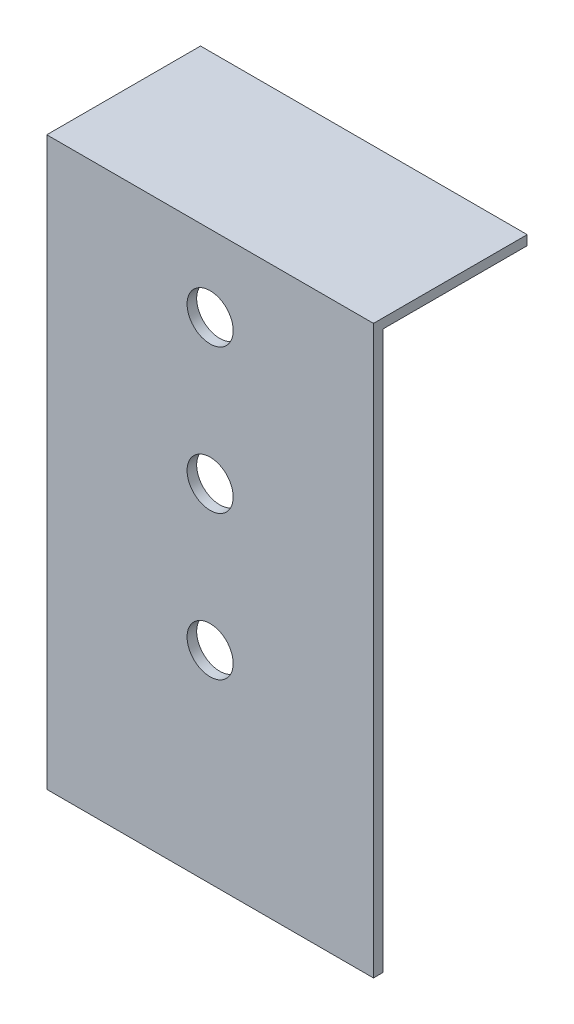
ISO-10303-21;
HEADER;
FILE_DESCRIPTION(('STEP AP214'),'2;1');
FILE_NAME('part.step','',(''),(''),'','','');
FILE_SCHEMA(('AUTOMOTIVE_DESIGN { 1 0 10303 214 1 1 1 1 }'));
ENDSEC;
DATA;
#1=APPLICATION_CONTEXT('core data for automotive mechanical design processes');
#2=APPLICATION_PROTOCOL_DEFINITION('international standard','automotive_design',2000,#1);
#3=PRODUCT_CONTEXT('',#1,'mechanical');
#4=PRODUCT('Part','Part','',(#3));
#5=PRODUCT_RELATED_PRODUCT_CATEGORY('part','',(#4));
#6=PRODUCT_DEFINITION_FORMATION('','',#4);
#7=PRODUCT_DEFINITION_CONTEXT('part definition',#1,'design');
#8=PRODUCT_DEFINITION('design','',#6,#7);
#9=PRODUCT_DEFINITION_SHAPE('','',#8);
#10=(LENGTH_UNIT() NAMED_UNIT(*) SI_UNIT(.MILLI.,.METRE.));
#11=(NAMED_UNIT(*) PLANE_ANGLE_UNIT() SI_UNIT($,.RADIAN.));
#12=(NAMED_UNIT(*) SI_UNIT($,.STERADIAN.) SOLID_ANGLE_UNIT());
#13=UNCERTAINTY_MEASURE_WITH_UNIT(LENGTH_MEASURE(1.E-05),#10,'distance_accuracy_value','');
#14=(GEOMETRIC_REPRESENTATION_CONTEXT(3) GLOBAL_UNCERTAINTY_ASSIGNED_CONTEXT((#13)) GLOBAL_UNIT_ASSIGNED_CONTEXT((#10,
#11,#12)) REPRESENTATION_CONTEXT('',''));
#15=CARTESIAN_POINT('',(0.,0.,0.));
#16=DIRECTION('',(0.,0.,1.));
#17=DIRECTION('',(1.,0.,0.));
#18=AXIS2_PLACEMENT_3D('',#15,#16,#17);
#19=CARTESIAN_POINT('',(-43.18,149.86,-1.27));
#20=DIRECTION('',(0.,0.,1.));
#21=DIRECTION('',(1.,0.,0.));
#22=AXIS2_PLACEMENT_3D('',#19,#20,#21);
#23=PLANE('',#22);
#24=CARTESIAN_POINT('',(0.,129.65541120455,-1.27));
#25=DIRECTION('',(0.,0.,1.));
#26=DIRECTION('',(1.,0.,0.));
#27=AXIS2_PLACEMENT_3D('',#24,#25,#26);
#28=CIRCLE('',#27,6.096);
#29=CARTESIAN_POINT('',(6.096,129.65541120455,-1.27));
#30=VERTEX_POINT('',#29);
#31=EDGE_CURVE('E134',#30,#30,#28,.T.);
#32=ORIENTED_EDGE('',*,*,#31,.T.);
#33=EDGE_LOOP('',(#32));
#34=FACE_BOUND('',#33,.T.);
#35=CARTESIAN_POINT('',(0.,91.55541120455,-1.27));
#36=DIRECTION('',(0.,0.,1.));
#37=DIRECTION('',(1.,0.,0.));
#38=AXIS2_PLACEMENT_3D('',#35,#36,#37);
#39=CIRCLE('',#38,6.096);
#40=CARTESIAN_POINT('',(6.096,91.55541120455,-1.27));
#41=VERTEX_POINT('',#40);
#42=EDGE_CURVE('E259',#41,#41,#39,.T.);
#43=ORIENTED_EDGE('',*,*,#42,.T.);
#44=EDGE_LOOP('',(#43));
#45=FACE_BOUND('',#44,.T.);
#46=CARTESIAN_POINT('',(0.,53.45541120455,-1.27));
#47=DIRECTION('',(0.,0.,1.));
#48=DIRECTION('',(1.,0.,0.));
#49=AXIS2_PLACEMENT_3D('',#46,#47,#48);
#50=CIRCLE('',#49,6.096);
#51=CARTESIAN_POINT('',(6.096,53.45541120455,-1.27));
#52=VERTEX_POINT('',#51);
#53=EDGE_CURVE('E261',#52,#52,#50,.T.);
#54=ORIENTED_EDGE('',*,*,#53,.T.);
#55=EDGE_LOOP('',(#54));
#56=FACE_BOUND('',#55,.T.);
#57=DIRECTION('',(-1.,0.,0.));
#58=VECTOR('',#57,1.);
#59=CARTESIAN_POINT('',(43.18,147.32,-1.27));
#60=LINE('',#59,#58);
#61=CARTESIAN_POINT('',(43.18,147.32,-1.27));
#62=VERTEX_POINT('',#61);
#63=CARTESIAN_POINT('',(-43.18,147.32,-1.27));
#64=VERTEX_POINT('',#63);
#65=EDGE_CURVE('E49',#62,#64,#60,.T.);
#66=ORIENTED_EDGE('',*,*,#65,.F.);
#67=DIRECTION('',(0.,-1.,0.));
#68=VECTOR('',#67,1.);
#69=CARTESIAN_POINT('',(43.18,149.86,-1.27));
#70=LINE('',#69,#68);
#71=CARTESIAN_POINT('',(43.18,0.,-1.27));
#72=VERTEX_POINT('',#71);
#73=EDGE_CURVE('E11',#62,#72,#70,.T.);
#74=ORIENTED_EDGE('',*,*,#73,.T.);
#75=DIRECTION('',(-1.,0.,0.));
#76=VECTOR('',#75,1.);
#77=CARTESIAN_POINT('',(-43.18,0.,-1.27));
#78=LINE('',#77,#76);
#79=CARTESIAN_POINT('',(-43.18,0.,-1.27));
#80=VERTEX_POINT('',#79);
#81=EDGE_CURVE('E97',#72,#80,#78,.T.);
#82=ORIENTED_EDGE('',*,*,#81,.T.);
#83=DIRECTION('',(0.,-1.,0.));
#84=VECTOR('',#83,1.);
#85=CARTESIAN_POINT('',(-43.18,149.86,-1.27));
#86=LINE('',#85,#84);
#87=EDGE_CURVE('E43',#64,#80,#86,.T.);
#88=ORIENTED_EDGE('',*,*,#87,.F.);
#89=EDGE_LOOP('',(#66,#74,#82,#88));
#90=FACE_BOUND('',#89,.T.);
#91=ADVANCED_FACE('F35',(#34,#45,#56,#90),#23,.F.);
#92=CARTESIAN_POINT('',(43.18,149.86,1.27));
#93=DIRECTION('',(-1.,0.,0.));
#94=DIRECTION('',(0.,0.,1.));
#95=AXIS2_PLACEMENT_3D('',#92,#93,#94);
#96=PLANE('',#95);
#97=DIRECTION('',(0.,0.,-1.));
#98=VECTOR('',#97,1.);
#99=CARTESIAN_POINT('',(43.18,0.,1.27));
#100=LINE('',#99,#98);
#101=CARTESIAN_POINT('',(43.18,0.,1.27));
#102=VERTEX_POINT('',#101);
#103=EDGE_CURVE('E91',#102,#72,#100,.T.);
#104=ORIENTED_EDGE('',*,*,#103,.T.);
#105=ORIENTED_EDGE('',*,*,#73,.F.);
#106=DIRECTION('',(0.,0.,1.));
#107=VECTOR('',#106,1.);
#108=CARTESIAN_POINT('',(43.18,147.32,-39.37));
#109=LINE('',#108,#107);
#110=CARTESIAN_POINT('',(43.18,147.32,-39.37));
#111=VERTEX_POINT('',#110);
#112=EDGE_CURVE('E98',#111,#62,#109,.T.);
#113=ORIENTED_EDGE('',*,*,#112,.F.);
#114=DIRECTION('',(0.,-1.,0.));
#115=VECTOR('',#114,1.);
#116=CARTESIAN_POINT('',(43.18,149.86,-39.37));
#117=LINE('',#116,#115);
#118=CARTESIAN_POINT('',(43.18,149.86,-39.37));
#119=VERTEX_POINT('',#118);
#120=EDGE_CURVE('E127',#119,#111,#117,.T.);
#121=ORIENTED_EDGE('',*,*,#120,.F.);
#122=DIRECTION('',(0.,0.,-1.));
#123=VECTOR('',#122,1.);
#124=CARTESIAN_POINT('',(43.18,149.86,1.27));
#125=LINE('',#124,#123);
#126=CARTESIAN_POINT('',(43.18,149.86,1.27));
#127=VERTEX_POINT('',#126);
#128=EDGE_CURVE('E86',#127,#119,#125,.T.);
#129=ORIENTED_EDGE('',*,*,#128,.F.);
#130=DIRECTION('',(0.,-1.,0.));
#131=VECTOR('',#130,1.);
#132=CARTESIAN_POINT('',(43.18,149.86,1.27));
#133=LINE('',#132,#131);
#134=EDGE_CURVE('E79',#127,#102,#133,.T.);
#135=ORIENTED_EDGE('',*,*,#134,.T.);
#136=EDGE_LOOP('',(#104,#105,#113,#121,#129,#135));
#137=FACE_BOUND('',#136,.T.);
#138=ADVANCED_FACE('F37',(#137),#96,.F.);
#139=CARTESIAN_POINT('',(-43.18,149.86,1.27));
#140=DIRECTION('',(1.,0.,0.));
#141=DIRECTION('',(0.,0.,-1.));
#142=AXIS2_PLACEMENT_3D('',#139,#140,#141);
#143=PLANE('',#142);
#144=DIRECTION('',(0.,0.,1.));
#145=VECTOR('',#144,1.);
#146=CARTESIAN_POINT('',(-43.18,0.,1.27));
#147=LINE('',#146,#145);
#148=CARTESIAN_POINT('',(-43.18,0.,1.27));
#149=VERTEX_POINT('',#148);
#150=EDGE_CURVE('E87',#80,#149,#147,.T.);
#151=ORIENTED_EDGE('',*,*,#150,.T.);
#152=DIRECTION('',(0.,-1.,0.));
#153=VECTOR('',#152,1.);
#154=CARTESIAN_POINT('',(-43.18,149.86,1.27));
#155=LINE('',#154,#153);
#156=CARTESIAN_POINT('',(-43.18,149.86,1.27));
#157=VERTEX_POINT('',#156);
#158=EDGE_CURVE('E82',#157,#149,#155,.T.);
#159=ORIENTED_EDGE('',*,*,#158,.F.);
#160=DIRECTION('',(0.,0.,1.));
#161=VECTOR('',#160,1.);
#162=CARTESIAN_POINT('',(-43.18,149.86,1.27));
#163=LINE('',#162,#161);
#164=CARTESIAN_POINT('',(-43.18,149.86,-39.37));
#165=VERTEX_POINT('',#164);
#166=EDGE_CURVE('E142',#165,#157,#163,.T.);
#167=ORIENTED_EDGE('',*,*,#166,.F.);
#168=DIRECTION('',(0.,1.,0.));
#169=VECTOR('',#168,1.);
#170=CARTESIAN_POINT('',(-43.18,149.86,-39.37));
#171=LINE('',#170,#169);
#172=CARTESIAN_POINT('',(-43.18,147.32,-39.37));
#173=VERTEX_POINT('',#172);
#174=EDGE_CURVE('E126',#173,#165,#171,.T.);
#175=ORIENTED_EDGE('',*,*,#174,.F.);
#176=DIRECTION('',(0.,0.,1.));
#177=VECTOR('',#176,1.);
#178=CARTESIAN_POINT('',(-43.18,147.32,-39.37));
#179=LINE('',#178,#177);
#180=EDGE_CURVE('E102',#173,#64,#179,.T.);
#181=ORIENTED_EDGE('',*,*,#180,.T.);
#182=ORIENTED_EDGE('',*,*,#87,.T.);
#183=EDGE_LOOP('',(#151,#159,#167,#175,#181,#182));
#184=FACE_BOUND('',#183,.T.);
#185=ADVANCED_FACE('F110',(#184),#143,.F.);
#186=CARTESIAN_POINT('',(-43.18,149.86,1.27));
#187=DIRECTION('',(0.,0.,-1.));
#188=DIRECTION('',(-1.,0.,0.));
#189=AXIS2_PLACEMENT_3D('',#186,#187,#188);
#190=PLANE('',#189);
#191=CARTESIAN_POINT('',(0.,129.65541120455,1.27));
#192=DIRECTION('',(0.,0.,1.));
#193=DIRECTION('',(1.,0.,0.));
#194=AXIS2_PLACEMENT_3D('',#191,#192,#193);
#195=CIRCLE('',#194,6.096);
#196=CARTESIAN_POINT('',(6.096,129.65541120455,1.27));
#197=VERTEX_POINT('',#196);
#198=EDGE_CURVE('E257',#197,#197,#195,.T.);
#199=ORIENTED_EDGE('',*,*,#198,.F.);
#200=EDGE_LOOP('',(#199));
#201=FACE_BOUND('',#200,.T.);
#202=CARTESIAN_POINT('',(0.,91.55541120455,1.27));
#203=DIRECTION('',(0.,0.,1.));
#204=DIRECTION('',(1.,0.,0.));
#205=AXIS2_PLACEMENT_3D('',#202,#203,#204);
#206=CIRCLE('',#205,6.096);
#207=CARTESIAN_POINT('',(6.096,91.55541120455,1.27));
#208=VERTEX_POINT('',#207);
#209=EDGE_CURVE('E269',#208,#208,#206,.T.);
#210=ORIENTED_EDGE('',*,*,#209,.F.);
#211=EDGE_LOOP('',(#210));
#212=FACE_BOUND('',#211,.T.);
#213=CARTESIAN_POINT('',(0.,53.45541120455,1.27));
#214=DIRECTION('',(0.,0.,1.));
#215=DIRECTION('',(1.,0.,0.));
#216=AXIS2_PLACEMENT_3D('',#213,#214,#215);
#217=CIRCLE('',#216,6.096);
#218=CARTESIAN_POINT('',(6.096,53.45541120455,1.27));
#219=VERTEX_POINT('',#218);
#220=EDGE_CURVE('E266',#219,#219,#217,.T.);
#221=ORIENTED_EDGE('',*,*,#220,.F.);
#222=EDGE_LOOP('',(#221));
#223=FACE_BOUND('',#222,.T.);
#224=DIRECTION('',(1.,0.,0.));
#225=VECTOR('',#224,1.);
#226=CARTESIAN_POINT('',(-43.18,0.,1.27));
#227=LINE('',#226,#225);
#228=EDGE_CURVE('E76',#149,#102,#227,.T.);
#229=ORIENTED_EDGE('',*,*,#228,.T.);
#230=ORIENTED_EDGE('',*,*,#134,.F.);
#231=DIRECTION('',(1.,0.,0.));
#232=VECTOR('',#231,1.);
#233=CARTESIAN_POINT('',(-43.18,149.86,1.27));
#234=LINE('',#233,#232);
#235=EDGE_CURVE('E58',#157,#127,#234,.T.);
#236=ORIENTED_EDGE('',*,*,#235,.F.);
#237=ORIENTED_EDGE('',*,*,#158,.T.);
#238=EDGE_LOOP('',(#229,#230,#236,#237));
#239=FACE_BOUND('',#238,.T.);
#240=ADVANCED_FACE('F78',(#201,#212,#223,#239),#190,.F.);
#241=CARTESIAN_POINT('',(0.,149.86,0.));
#242=DIRECTION('',(0.,-1.,0.));
#243=DIRECTION('',(0.,0.,-1.));
#244=AXIS2_PLACEMENT_3D('',#241,#242,#243);
#245=PLANE('',#244);
#246=ORIENTED_EDGE('',*,*,#128,.T.);
#247=DIRECTION('',(1.,0.,0.));
#248=VECTOR('',#247,1.);
#249=CARTESIAN_POINT('',(43.18,149.86,-39.37));
#250=LINE('',#249,#248);
#251=EDGE_CURVE('E132',#165,#119,#250,.T.);
#252=ORIENTED_EDGE('',*,*,#251,.F.);
#253=ORIENTED_EDGE('',*,*,#166,.T.);
#254=ORIENTED_EDGE('',*,*,#235,.T.);
#255=EDGE_LOOP('',(#246,#252,#253,#254));
#256=FACE_BOUND('',#255,.T.);
#257=ADVANCED_FACE('F144',(#256),#245,.F.);
#258=CARTESIAN_POINT('',(0.,0.,0.));
#259=DIRECTION('',(0.,-1.,0.));
#260=DIRECTION('',(0.,0.,-1.));
#261=AXIS2_PLACEMENT_3D('',#258,#259,#260);
#262=PLANE('',#261);
#263=ORIENTED_EDGE('',*,*,#103,.F.);
#264=ORIENTED_EDGE('',*,*,#228,.F.);
#265=ORIENTED_EDGE('',*,*,#150,.F.);
#266=ORIENTED_EDGE('',*,*,#81,.F.);
#267=EDGE_LOOP('',(#263,#264,#265,#266));
#268=FACE_BOUND('',#267,.T.);
#269=ADVANCED_FACE('F95',(#268),#262,.T.);
#270=CARTESIAN_POINT('',(43.18,147.32,-39.37));
#271=DIRECTION('',(0.,1.,0.));
#272=DIRECTION('',(0.,0.,1.));
#273=AXIS2_PLACEMENT_3D('',#270,#271,#272);
#274=PLANE('',#273);
#275=ORIENTED_EDGE('',*,*,#65,.T.);
#276=ORIENTED_EDGE('',*,*,#180,.F.);
#277=DIRECTION('',(-1.,0.,0.));
#278=VECTOR('',#277,1.);
#279=CARTESIAN_POINT('',(43.18,147.32,-39.37));
#280=LINE('',#279,#278);
#281=EDGE_CURVE('E120',#111,#173,#280,.T.);
#282=ORIENTED_EDGE('',*,*,#281,.F.);
#283=ORIENTED_EDGE('',*,*,#112,.T.);
#284=EDGE_LOOP('',(#275,#276,#282,#283));
#285=FACE_BOUND('',#284,.T.);
#286=ADVANCED_FACE('F118',(#285),#274,.F.);
#287=CARTESIAN_POINT('',(0.,0.,-39.37));
#288=DIRECTION('',(0.,0.,-1.));
#289=DIRECTION('',(-1.,0.,0.));
#290=AXIS2_PLACEMENT_3D('',#287,#288,#289);
#291=PLANE('',#290);
#292=ORIENTED_EDGE('',*,*,#120,.T.);
#293=ORIENTED_EDGE('',*,*,#281,.T.);
#294=ORIENTED_EDGE('',*,*,#174,.T.);
#295=ORIENTED_EDGE('',*,*,#251,.T.);
#296=EDGE_LOOP('',(#292,#293,#294,#295));
#297=FACE_BOUND('',#296,.T.);
#298=ADVANCED_FACE('F130',(#297),#291,.T.);
#299=CARTESIAN_POINT('',(0.,53.45541120455,-39.37));
#300=DIRECTION('',(0.,0.,1.));
#301=DIRECTION('',(1.,0.,0.));
#302=AXIS2_PLACEMENT_3D('',#299,#300,#301);
#303=CYLINDRICAL_SURFACE('',#302,6.096);
#304=ORIENTED_EDGE('',*,*,#220,.T.);
#305=EDGE_LOOP('',(#304));
#306=FACE_BOUND('',#305,.T.);
#307=ORIENTED_EDGE('',*,*,#53,.F.);
#308=EDGE_LOOP('',(#307));
#309=FACE_BOUND('',#308,.T.);
#310=ADVANCED_FACE('F186',(#306,#309),#303,.F.);
#311=CARTESIAN_POINT('',(0.,91.55541120455,-39.37));
#312=DIRECTION('',(0.,0.,1.));
#313=DIRECTION('',(1.,0.,0.));
#314=AXIS2_PLACEMENT_3D('',#311,#312,#313);
#315=CYLINDRICAL_SURFACE('',#314,6.096);
#316=ORIENTED_EDGE('',*,*,#209,.T.);
#317=EDGE_LOOP('',(#316));
#318=FACE_BOUND('',#317,.T.);
#319=ORIENTED_EDGE('',*,*,#42,.F.);
#320=EDGE_LOOP('',(#319));
#321=FACE_BOUND('',#320,.T.);
#322=ADVANCED_FACE('F191',(#318,#321),#315,.F.);
#323=CARTESIAN_POINT('',(0.,129.65541120455,-39.37));
#324=DIRECTION('',(0.,0.,1.));
#325=DIRECTION('',(1.,0.,0.));
#326=AXIS2_PLACEMENT_3D('',#323,#324,#325);
#327=CYLINDRICAL_SURFACE('',#326,6.096);
#328=ORIENTED_EDGE('',*,*,#198,.T.);
#329=EDGE_LOOP('',(#328));
#330=FACE_BOUND('',#329,.T.);
#331=ORIENTED_EDGE('',*,*,#31,.F.);
#332=EDGE_LOOP('',(#331));
#333=FACE_BOUND('',#332,.T.);
#334=ADVANCED_FACE('F203',(#330,#333),#327,.F.);
#335=CLOSED_SHELL('',(#91,#138,#185,#240,#257,#269,#286,#298,#310,#322,#334));
#336=MANIFOLD_SOLID_BREP('B2',#335);
#337=ADVANCED_BREP_SHAPE_REPRESENTATION('',(#18,#336),#14);
#338=SHAPE_DEFINITION_REPRESENTATION(#9,#337);
ENDSEC;
END-ISO-10303-21;
